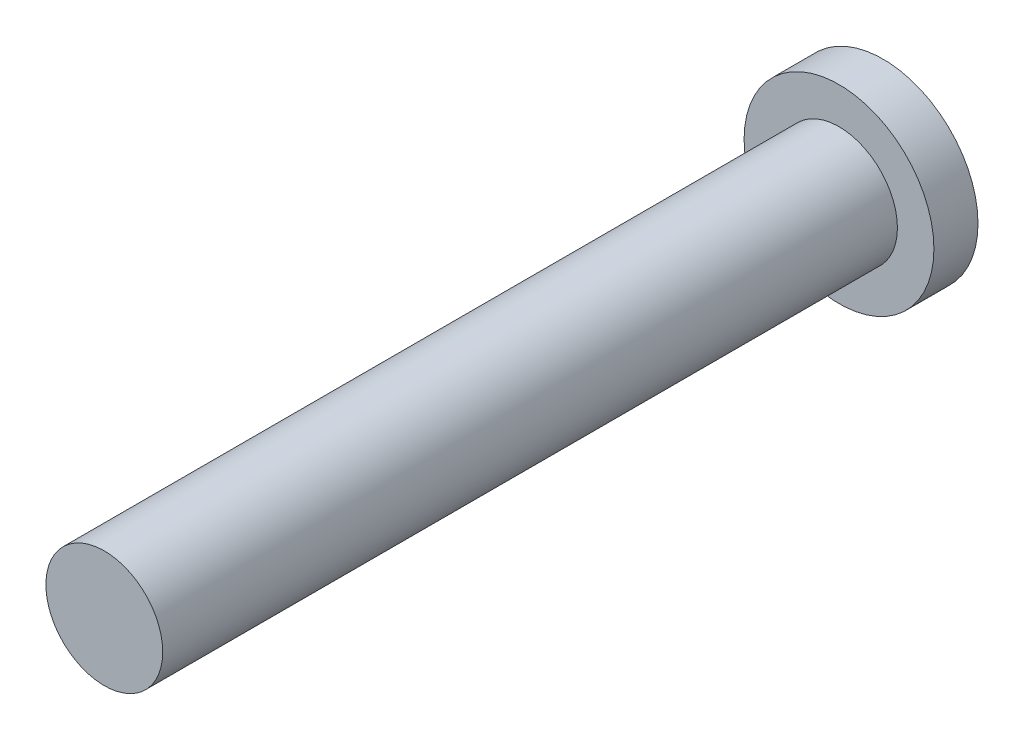
ISO-10303-21;
HEADER;
FILE_DESCRIPTION(('STEP AP214'),'2;1');
FILE_NAME('part.step','',(''),(''),'','','');
FILE_SCHEMA(('AUTOMOTIVE_DESIGN { 1 0 10303 214 1 1 1 1 }'));
ENDSEC;
DATA;
#1=APPLICATION_CONTEXT('core data for automotive mechanical design processes');
#2=APPLICATION_PROTOCOL_DEFINITION('international standard','automotive_design',2000,#1);
#3=PRODUCT_CONTEXT('',#1,'mechanical');
#4=PRODUCT('Part','Part','',(#3));
#5=PRODUCT_RELATED_PRODUCT_CATEGORY('part','',(#4));
#6=PRODUCT_DEFINITION_FORMATION('','',#4);
#7=PRODUCT_DEFINITION_CONTEXT('part definition',#1,'design');
#8=PRODUCT_DEFINITION('design','',#6,#7);
#9=PRODUCT_DEFINITION_SHAPE('','',#8);
#10=(LENGTH_UNIT() NAMED_UNIT(*) SI_UNIT(.MILLI.,.METRE.));
#11=(NAMED_UNIT(*) PLANE_ANGLE_UNIT() SI_UNIT($,.RADIAN.));
#12=(NAMED_UNIT(*) SI_UNIT($,.STERADIAN.) SOLID_ANGLE_UNIT());
#13=UNCERTAINTY_MEASURE_WITH_UNIT(LENGTH_MEASURE(1.E-05),#10,'distance_accuracy_value','');
#14=(GEOMETRIC_REPRESENTATION_CONTEXT(3) GLOBAL_UNCERTAINTY_ASSIGNED_CONTEXT((#13)) GLOBAL_UNIT_ASSIGNED_CONTEXT((#10,
#11,#12)) REPRESENTATION_CONTEXT('',''));
#15=CARTESIAN_POINT('',(0.,0.,0.));
#16=DIRECTION('',(0.,0.,1.));
#17=DIRECTION('',(1.,0.,0.));
#18=AXIS2_PLACEMENT_3D('',#15,#16,#17);
#19=CARTESIAN_POINT('',(0.,0.,1.2));
#20=DIRECTION('',(0.,0.,-1.));
#21=DIRECTION('',(-1.,0.,0.));
#22=AXIS2_PLACEMENT_3D('',#19,#20,#21);
#23=CYLINDRICAL_SURFACE('',#22,2.58375);
#24=CARTESIAN_POINT('',(0.,0.,1.2));
#25=DIRECTION('',(0.,0.,1.));
#26=DIRECTION('',(1.,0.,0.));
#27=AXIS2_PLACEMENT_3D('',#24,#25,#26);
#28=CIRCLE('',#27,2.58375);
#29=CARTESIAN_POINT('',(2.58375,0.,1.2));
#30=VERTEX_POINT('',#29);
#31=EDGE_CURVE('E10',#30,#30,#28,.T.);
#32=ORIENTED_EDGE('',*,*,#31,.F.);
#33=EDGE_LOOP('',(#32));
#34=FACE_BOUND('',#33,.T.);
#35=CARTESIAN_POINT('',(0.,0.,0.));
#36=DIRECTION('',(0.,0.,1.));
#37=DIRECTION('',(1.,0.,0.));
#38=AXIS2_PLACEMENT_3D('',#35,#36,#37);
#39=CIRCLE('',#38,2.58375);
#40=CARTESIAN_POINT('',(2.58375,0.,0.));
#41=VERTEX_POINT('',#40);
#42=EDGE_CURVE('E34',#41,#41,#39,.T.);
#43=ORIENTED_EDGE('',*,*,#42,.T.);
#44=EDGE_LOOP('',(#43));
#45=FACE_BOUND('',#44,.T.);
#46=ADVANCED_FACE('F31',(#34,#45),#23,.T.);
#47=CARTESIAN_POINT('',(0.,0.,1.2));
#48=DIRECTION('',(0.,0.,1.));
#49=DIRECTION('',(1.,0.,0.));
#50=AXIS2_PLACEMENT_3D('',#47,#48,#49);
#51=PLANE('',#50);
#52=CARTESIAN_POINT('',(0.,0.,1.2));
#53=DIRECTION('',(0.,0.,1.));
#54=DIRECTION('',(1.,0.,0.));
#55=AXIS2_PLACEMENT_3D('',#52,#53,#54);
#56=CIRCLE('',#55,1.59);
#57=CARTESIAN_POINT('',(1.59,0.,1.2));
#58=VERTEX_POINT('',#57);
#59=EDGE_CURVE('E43',#58,#58,#56,.T.);
#60=ORIENTED_EDGE('',*,*,#59,.F.);
#61=EDGE_LOOP('',(#60));
#62=FACE_BOUND('',#61,.T.);
#63=ORIENTED_EDGE('',*,*,#31,.T.);
#64=EDGE_LOOP('',(#63));
#65=FACE_BOUND('',#64,.T.);
#66=ADVANCED_FACE('F58',(#62,#65),#51,.T.);
#67=CARTESIAN_POINT('',(0.,0.,0.));
#68=DIRECTION('',(0.,0.,1.));
#69=DIRECTION('',(1.,0.,0.));
#70=AXIS2_PLACEMENT_3D('',#67,#68,#69);
#71=PLANE('',#70);
#72=ORIENTED_EDGE('',*,*,#42,.F.);
#73=EDGE_LOOP('',(#72));
#74=FACE_BOUND('',#73,.T.);
#75=ADVANCED_FACE('F54',(#74),#71,.F.);
#76=CARTESIAN_POINT('',(0.,0.,21.2));
#77=DIRECTION('',(0.,0.,-1.));
#78=DIRECTION('',(-1.,0.,0.));
#79=AXIS2_PLACEMENT_3D('',#76,#77,#78);
#80=CYLINDRICAL_SURFACE('',#79,1.59);
#81=CARTESIAN_POINT('',(0.,0.,21.2));
#82=DIRECTION('',(0.,0.,1.));
#83=DIRECTION('',(1.,0.,0.));
#84=AXIS2_PLACEMENT_3D('',#81,#82,#83);
#85=CIRCLE('',#84,1.59);
#86=CARTESIAN_POINT('',(1.59,0.,21.2));
#87=VERTEX_POINT('',#86);
#88=EDGE_CURVE('E41',#87,#87,#85,.T.);
#89=ORIENTED_EDGE('',*,*,#88,.F.);
#90=EDGE_LOOP('',(#89));
#91=FACE_BOUND('',#90,.T.);
#92=ORIENTED_EDGE('',*,*,#59,.T.);
#93=EDGE_LOOP('',(#92));
#94=FACE_BOUND('',#93,.T.);
#95=ADVANCED_FACE('F51',(#91,#94),#80,.T.);
#96=CARTESIAN_POINT('',(0.,0.,21.2));
#97=DIRECTION('',(0.,0.,1.));
#98=DIRECTION('',(1.,0.,0.));
#99=AXIS2_PLACEMENT_3D('',#96,#97,#98);
#100=PLANE('',#99);
#101=ORIENTED_EDGE('',*,*,#88,.T.);
#102=EDGE_LOOP('',(#101));
#103=FACE_BOUND('',#102,.T.);
#104=ADVANCED_FACE('F49',(#103),#100,.T.);
#105=CLOSED_SHELL('',(#46,#66,#75,#95,#104));
#106=MANIFOLD_SOLID_BREP('B2',#105);
#107=ADVANCED_BREP_SHAPE_REPRESENTATION('',(#18,#106),#14);
#108=SHAPE_DEFINITION_REPRESENTATION(#9,#107);
ENDSEC;
END-ISO-10303-21;
